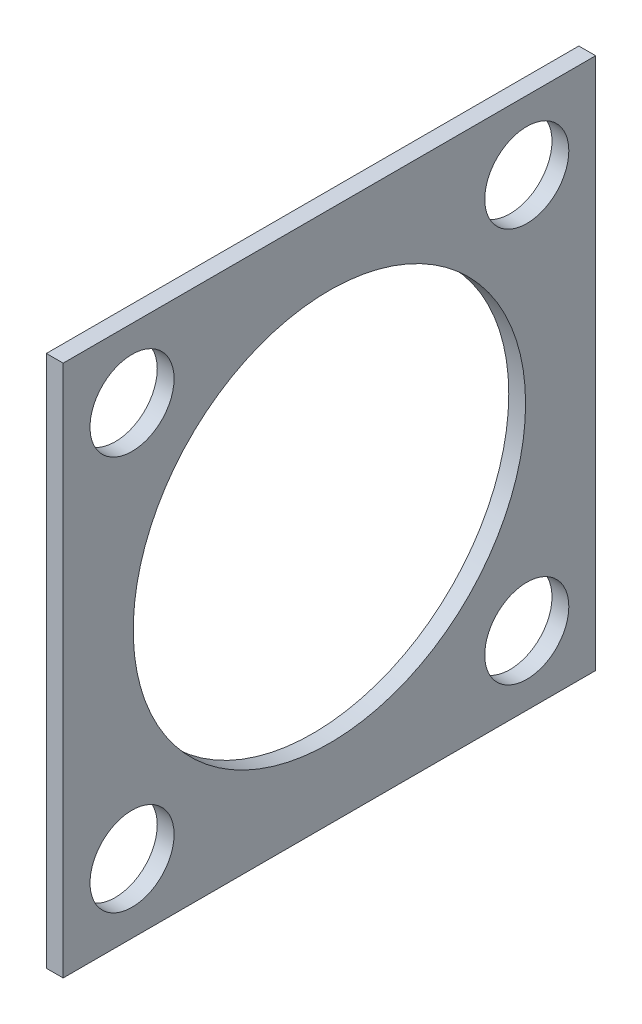
ISO-10303-21;
HEADER;
FILE_DESCRIPTION(('STEP AP214'),'2;1');
FILE_NAME('part.step','',(''),(''),'','','');
FILE_SCHEMA(('AUTOMOTIVE_DESIGN { 1 0 10303 214 1 1 1 1 }'));
ENDSEC;
DATA;
#1=APPLICATION_CONTEXT('core data for automotive mechanical design processes');
#2=APPLICATION_PROTOCOL_DEFINITION('international standard','automotive_design',2000,#1);
#3=PRODUCT_CONTEXT('',#1,'mechanical');
#4=PRODUCT('Part','Part','',(#3));
#5=PRODUCT_RELATED_PRODUCT_CATEGORY('part','',(#4));
#6=PRODUCT_DEFINITION_FORMATION('','',#4);
#7=PRODUCT_DEFINITION_CONTEXT('part definition',#1,'design');
#8=PRODUCT_DEFINITION('design','',#6,#7);
#9=PRODUCT_DEFINITION_SHAPE('','',#8);
#10=(LENGTH_UNIT() NAMED_UNIT(*) SI_UNIT(.MILLI.,.METRE.));
#11=(NAMED_UNIT(*) PLANE_ANGLE_UNIT() SI_UNIT($,.RADIAN.));
#12=(NAMED_UNIT(*) SI_UNIT($,.STERADIAN.) SOLID_ANGLE_UNIT());
#13=UNCERTAINTY_MEASURE_WITH_UNIT(LENGTH_MEASURE(1.E-05),#10,'distance_accuracy_value','');
#14=(GEOMETRIC_REPRESENTATION_CONTEXT(3) GLOBAL_UNCERTAINTY_ASSIGNED_CONTEXT((#13)) GLOBAL_UNIT_ASSIGNED_CONTEXT((#10,
#11,#12)) REPRESENTATION_CONTEXT('',''));
#15=CARTESIAN_POINT('',(0.,0.,0.));
#16=DIRECTION('',(0.,0.,1.));
#17=DIRECTION('',(1.,0.,0.));
#18=AXIS2_PLACEMENT_3D('',#15,#16,#17);
#19=CARTESIAN_POINT('',(-1.2,-19.,-19.));
#20=DIRECTION('',(0.,0.,-1.));
#21=DIRECTION('',(-1.,0.,0.));
#22=AXIS2_PLACEMENT_3D('',#19,#20,#21);
#23=PLANE('',#22);
#24=DIRECTION('',(0.,1.,0.));
#25=VECTOR('',#24,1.);
#26=CARTESIAN_POINT('',(0.,-19.,-19.));
#27=LINE('',#26,#25);
#28=CARTESIAN_POINT('',(0.,-19.,-19.));
#29=VERTEX_POINT('',#28);
#30=CARTESIAN_POINT('',(0.,19.,-19.));
#31=VERTEX_POINT('',#30);
#32=EDGE_CURVE('E113',#29,#31,#27,.T.);
#33=ORIENTED_EDGE('',*,*,#32,.F.);
#34=DIRECTION('',(1.,0.,0.));
#35=VECTOR('',#34,1.);
#36=CARTESIAN_POINT('',(-1.2,-19.,-19.));
#37=LINE('',#36,#35);
#38=CARTESIAN_POINT('',(-1.2,-19.,-19.));
#39=VERTEX_POINT('',#38);
#40=EDGE_CURVE('E13',#39,#29,#37,.T.);
#41=ORIENTED_EDGE('',*,*,#40,.F.);
#42=DIRECTION('',(0.,1.,0.));
#43=VECTOR('',#42,1.);
#44=CARTESIAN_POINT('',(-1.2,-19.,-19.));
#45=LINE('',#44,#43);
#46=CARTESIAN_POINT('',(-1.2,19.,-19.));
#47=VERTEX_POINT('',#46);
#48=EDGE_CURVE('E106',#39,#47,#45,.T.);
#49=ORIENTED_EDGE('',*,*,#48,.T.);
#50=DIRECTION('',(1.,0.,0.));
#51=VECTOR('',#50,1.);
#52=CARTESIAN_POINT('',(-1.2,19.,-19.));
#53=LINE('',#52,#51);
#54=EDGE_CURVE('E51',#47,#31,#53,.T.);
#55=ORIENTED_EDGE('',*,*,#54,.T.);
#56=EDGE_LOOP('',(#33,#41,#49,#55));
#57=FACE_BOUND('',#56,.T.);
#58=ADVANCED_FACE('F48',(#57),#23,.T.);
#59=CARTESIAN_POINT('',(-1.2,-19.,19.));
#60=DIRECTION('',(0.,-1.,0.));
#61=DIRECTION('',(0.,0.,-1.));
#62=AXIS2_PLACEMENT_3D('',#59,#60,#61);
#63=PLANE('',#62);
#64=DIRECTION('',(0.,0.,-1.));
#65=VECTOR('',#64,1.);
#66=CARTESIAN_POINT('',(0.,-19.,19.));
#67=LINE('',#66,#65);
#68=CARTESIAN_POINT('',(0.,-19.,19.));
#69=VERTEX_POINT('',#68);
#70=EDGE_CURVE('E108',#69,#29,#67,.T.);
#71=ORIENTED_EDGE('',*,*,#70,.F.);
#72=DIRECTION('',(1.,0.,0.));
#73=VECTOR('',#72,1.);
#74=CARTESIAN_POINT('',(-1.2,-19.,19.));
#75=LINE('',#74,#73);
#76=CARTESIAN_POINT('',(-1.2,-19.,19.));
#77=VERTEX_POINT('',#76);
#78=EDGE_CURVE('E57',#77,#69,#75,.T.);
#79=ORIENTED_EDGE('',*,*,#78,.F.);
#80=DIRECTION('',(0.,0.,-1.));
#81=VECTOR('',#80,1.);
#82=CARTESIAN_POINT('',(-1.2,-19.,19.));
#83=LINE('',#82,#81);
#84=EDGE_CURVE('E103',#77,#39,#83,.T.);
#85=ORIENTED_EDGE('',*,*,#84,.T.);
#86=ORIENTED_EDGE('',*,*,#40,.T.);
#87=EDGE_LOOP('',(#71,#79,#85,#86));
#88=FACE_BOUND('',#87,.T.);
#89=ADVANCED_FACE('F124',(#88),#63,.T.);
#90=CARTESIAN_POINT('',(-1.2,-19.,19.));
#91=DIRECTION('',(0.,0.,1.));
#92=DIRECTION('',(1.,0.,0.));
#93=AXIS2_PLACEMENT_3D('',#90,#91,#92);
#94=PLANE('',#93);
#95=DIRECTION('',(0.,-1.,0.));
#96=VECTOR('',#95,1.);
#97=CARTESIAN_POINT('',(0.,-19.,19.));
#98=LINE('',#97,#96);
#99=CARTESIAN_POINT('',(0.,19.,19.));
#100=VERTEX_POINT('',#99);
#101=EDGE_CURVE('E98',#100,#69,#98,.T.);
#102=ORIENTED_EDGE('',*,*,#101,.F.);
#103=DIRECTION('',(1.,0.,0.));
#104=VECTOR('',#103,1.);
#105=CARTESIAN_POINT('',(-1.2,19.,19.));
#106=LINE('',#105,#104);
#107=CARTESIAN_POINT('',(-1.2,19.,19.));
#108=VERTEX_POINT('',#107);
#109=EDGE_CURVE('E93',#108,#100,#106,.T.);
#110=ORIENTED_EDGE('',*,*,#109,.F.);
#111=DIRECTION('',(0.,-1.,0.));
#112=VECTOR('',#111,1.);
#113=CARTESIAN_POINT('',(-1.2,-19.,19.));
#114=LINE('',#113,#112);
#115=EDGE_CURVE('E96',#108,#77,#114,.T.);
#116=ORIENTED_EDGE('',*,*,#115,.T.);
#117=ORIENTED_EDGE('',*,*,#78,.T.);
#118=EDGE_LOOP('',(#102,#110,#116,#117));
#119=FACE_BOUND('',#118,.T.);
#120=ADVANCED_FACE('F95',(#119),#94,.T.);
#121=CARTESIAN_POINT('',(-1.2,19.,19.));
#122=DIRECTION('',(0.,1.,0.));
#123=DIRECTION('',(0.,0.,1.));
#124=AXIS2_PLACEMENT_3D('',#121,#122,#123);
#125=PLANE('',#124);
#126=DIRECTION('',(0.,0.,1.));
#127=VECTOR('',#126,1.);
#128=CARTESIAN_POINT('',(0.,19.,19.));
#129=LINE('',#128,#127);
#130=EDGE_CURVE('E116',#31,#100,#129,.T.);
#131=ORIENTED_EDGE('',*,*,#130,.F.);
#132=ORIENTED_EDGE('',*,*,#54,.F.);
#133=DIRECTION('',(0.,0.,1.));
#134=VECTOR('',#133,1.);
#135=CARTESIAN_POINT('',(-1.2,19.,19.));
#136=LINE('',#135,#134);
#137=EDGE_CURVE('E102',#47,#108,#136,.T.);
#138=ORIENTED_EDGE('',*,*,#137,.T.);
#139=ORIENTED_EDGE('',*,*,#109,.T.);
#140=EDGE_LOOP('',(#131,#132,#138,#139));
#141=FACE_BOUND('',#140,.T.);
#142=ADVANCED_FACE('F105',(#141),#125,.T.);
#143=CARTESIAN_POINT('',(-1.2,0.,0.));
#144=DIRECTION('',(-1.,0.,0.));
#145=DIRECTION('',(0.,0.,1.));
#146=AXIS2_PLACEMENT_3D('',#143,#144,#145);
#147=PLANE('',#146);
#148=CARTESIAN_POINT('',(-1.2,-14.085,-14.085));
#149=DIRECTION('',(1.,0.,0.));
#150=DIRECTION('',(0.,0.,-1.));
#151=AXIS2_PLACEMENT_3D('',#148,#149,#150);
#152=CIRCLE('',#151,3.);
#153=CARTESIAN_POINT('',(-1.2,-14.085,-17.085));
#154=VERTEX_POINT('',#153);
#155=EDGE_CURVE('E169',#154,#154,#152,.T.);
#156=ORIENTED_EDGE('',*,*,#155,.T.);
#157=EDGE_LOOP('',(#156));
#158=FACE_BOUND('',#157,.T.);
#159=CARTESIAN_POINT('',(-1.2,14.085,-14.085));
#160=DIRECTION('',(1.,0.,0.));
#161=DIRECTION('',(0.,0.,-1.));
#162=AXIS2_PLACEMENT_3D('',#159,#160,#161);
#163=CIRCLE('',#162,3.);
#164=CARTESIAN_POINT('',(-1.2,14.085,-17.085));
#165=VERTEX_POINT('',#164);
#166=EDGE_CURVE('E177',#165,#165,#163,.T.);
#167=ORIENTED_EDGE('',*,*,#166,.T.);
#168=EDGE_LOOP('',(#167));
#169=FACE_BOUND('',#168,.T.);
#170=CARTESIAN_POINT('',(-1.2,14.085,14.085));
#171=DIRECTION('',(1.,0.,0.));
#172=DIRECTION('',(0.,0.,-1.));
#173=AXIS2_PLACEMENT_3D('',#170,#171,#172);
#174=CIRCLE('',#173,3.);
#175=CARTESIAN_POINT('',(-1.2,14.085,11.085));
#176=VERTEX_POINT('',#175);
#177=EDGE_CURVE('E183',#176,#176,#174,.T.);
#178=ORIENTED_EDGE('',*,*,#177,.T.);
#179=EDGE_LOOP('',(#178));
#180=FACE_BOUND('',#179,.T.);
#181=CARTESIAN_POINT('',(-1.2,-14.085,14.085));
#182=DIRECTION('',(1.,0.,0.));
#183=DIRECTION('',(0.,0.,-1.));
#184=AXIS2_PLACEMENT_3D('',#181,#182,#183);
#185=CIRCLE('',#184,3.);
#186=CARTESIAN_POINT('',(-1.2,-14.085,11.085));
#187=VERTEX_POINT('',#186);
#188=EDGE_CURVE('E189',#187,#187,#185,.T.);
#189=ORIENTED_EDGE('',*,*,#188,.T.);
#190=EDGE_LOOP('',(#189));
#191=FACE_BOUND('',#190,.T.);
#192=CARTESIAN_POINT('',(-1.2,0.,0.));
#193=DIRECTION('',(1.,0.,0.));
#194=DIRECTION('',(0.,0.,-1.));
#195=AXIS2_PLACEMENT_3D('',#192,#193,#194);
#196=CIRCLE('',#195,14.);
#197=CARTESIAN_POINT('',(-1.2,0.,-14.));
#198=VERTEX_POINT('',#197);
#199=EDGE_CURVE('E117',#198,#198,#196,.T.);
#200=ORIENTED_EDGE('',*,*,#199,.T.);
#201=EDGE_LOOP('',(#200));
#202=FACE_BOUND('',#201,.T.);
#203=ORIENTED_EDGE('',*,*,#48,.F.);
#204=ORIENTED_EDGE('',*,*,#84,.F.);
#205=ORIENTED_EDGE('',*,*,#115,.F.);
#206=ORIENTED_EDGE('',*,*,#137,.F.);
#207=EDGE_LOOP('',(#203,#204,#205,#206));
#208=FACE_BOUND('',#207,.T.);
#209=ADVANCED_FACE('F101',(#158,#169,#180,#191,#202,#208),#147,.T.);
#210=CARTESIAN_POINT('',(0.,0.,0.));
#211=DIRECTION('',(-1.,0.,0.));
#212=DIRECTION('',(0.,0.,1.));
#213=AXIS2_PLACEMENT_3D('',#210,#211,#212);
#214=PLANE('',#213);
#215=CARTESIAN_POINT('',(0.,-14.085,-14.085));
#216=DIRECTION('',(1.,0.,0.));
#217=DIRECTION('',(0.,0.,-1.));
#218=AXIS2_PLACEMENT_3D('',#215,#216,#217);
#219=CIRCLE('',#218,3.);
#220=CARTESIAN_POINT('',(0.,-14.085,-17.085));
#221=VERTEX_POINT('',#220);
#222=EDGE_CURVE('E172',#221,#221,#219,.T.);
#223=ORIENTED_EDGE('',*,*,#222,.F.);
#224=EDGE_LOOP('',(#223));
#225=FACE_BOUND('',#224,.T.);
#226=CARTESIAN_POINT('',(0.,14.085,-14.085));
#227=DIRECTION('',(1.,0.,0.));
#228=DIRECTION('',(0.,0.,-1.));
#229=AXIS2_PLACEMENT_3D('',#226,#227,#228);
#230=CIRCLE('',#229,3.);
#231=CARTESIAN_POINT('',(0.,14.085,-17.085));
#232=VERTEX_POINT('',#231);
#233=EDGE_CURVE('E174',#232,#232,#230,.T.);
#234=ORIENTED_EDGE('',*,*,#233,.F.);
#235=EDGE_LOOP('',(#234));
#236=FACE_BOUND('',#235,.T.);
#237=CARTESIAN_POINT('',(0.,14.085,14.085));
#238=DIRECTION('',(1.,0.,0.));
#239=DIRECTION('',(0.,0.,-1.));
#240=AXIS2_PLACEMENT_3D('',#237,#238,#239);
#241=CIRCLE('',#240,3.);
#242=CARTESIAN_POINT('',(0.,14.085,11.085));
#243=VERTEX_POINT('',#242);
#244=EDGE_CURVE('E180',#243,#243,#241,.T.);
#245=ORIENTED_EDGE('',*,*,#244,.F.);
#246=EDGE_LOOP('',(#245));
#247=FACE_BOUND('',#246,.T.);
#248=CARTESIAN_POINT('',(0.,-14.085,14.085));
#249=DIRECTION('',(1.,0.,0.));
#250=DIRECTION('',(0.,0.,-1.));
#251=AXIS2_PLACEMENT_3D('',#248,#249,#250);
#252=CIRCLE('',#251,3.);
#253=CARTESIAN_POINT('',(0.,-14.085,11.085));
#254=VERTEX_POINT('',#253);
#255=EDGE_CURVE('E186',#254,#254,#252,.T.);
#256=ORIENTED_EDGE('',*,*,#255,.F.);
#257=EDGE_LOOP('',(#256));
#258=FACE_BOUND('',#257,.T.);
#259=CARTESIAN_POINT('',(0.,0.,0.));
#260=DIRECTION('',(1.,0.,0.));
#261=DIRECTION('',(0.,0.,-1.));
#262=AXIS2_PLACEMENT_3D('',#259,#260,#261);
#263=CIRCLE('',#262,14.);
#264=CARTESIAN_POINT('',(0.,0.,-14.));
#265=VERTEX_POINT('',#264);
#266=EDGE_CURVE('E192',#265,#265,#263,.T.);
#267=ORIENTED_EDGE('',*,*,#266,.F.);
#268=EDGE_LOOP('',(#267));
#269=FACE_BOUND('',#268,.T.);
#270=ORIENTED_EDGE('',*,*,#32,.T.);
#271=ORIENTED_EDGE('',*,*,#130,.T.);
#272=ORIENTED_EDGE('',*,*,#101,.T.);
#273=ORIENTED_EDGE('',*,*,#70,.T.);
#274=EDGE_LOOP('',(#270,#271,#272,#273));
#275=FACE_BOUND('',#274,.T.);
#276=ADVANCED_FACE('F123',(#225,#236,#247,#258,#269,#275),#214,.F.);
#277=CARTESIAN_POINT('',(-1.2,0.,0.));
#278=DIRECTION('',(1.,0.,0.));
#279=DIRECTION('',(0.,0.,-1.));
#280=AXIS2_PLACEMENT_3D('',#277,#278,#279);
#281=CYLINDRICAL_SURFACE('',#280,14.);
#282=ORIENTED_EDGE('',*,*,#199,.F.);
#283=EDGE_LOOP('',(#282));
#284=FACE_BOUND('',#283,.T.);
#285=ORIENTED_EDGE('',*,*,#266,.T.);
#286=EDGE_LOOP('',(#285));
#287=FACE_BOUND('',#286,.T.);
#288=ADVANCED_FACE('F142',(#284,#287),#281,.F.);
#289=CARTESIAN_POINT('',(-1.2,-14.085,14.085));
#290=DIRECTION('',(1.,0.,0.));
#291=DIRECTION('',(0.,0.,-1.));
#292=AXIS2_PLACEMENT_3D('',#289,#290,#291);
#293=CYLINDRICAL_SURFACE('',#292,3.);
#294=ORIENTED_EDGE('',*,*,#188,.F.);
#295=EDGE_LOOP('',(#294));
#296=FACE_BOUND('',#295,.T.);
#297=ORIENTED_EDGE('',*,*,#255,.T.);
#298=EDGE_LOOP('',(#297));
#299=FACE_BOUND('',#298,.T.);
#300=ADVANCED_FACE('F149',(#296,#299),#293,.F.);
#301=CARTESIAN_POINT('',(-1.2,14.085,14.085));
#302=DIRECTION('',(1.,0.,0.));
#303=DIRECTION('',(0.,0.,-1.));
#304=AXIS2_PLACEMENT_3D('',#301,#302,#303);
#305=CYLINDRICAL_SURFACE('',#304,3.);
#306=ORIENTED_EDGE('',*,*,#177,.F.);
#307=EDGE_LOOP('',(#306));
#308=FACE_BOUND('',#307,.T.);
#309=ORIENTED_EDGE('',*,*,#244,.T.);
#310=EDGE_LOOP('',(#309));
#311=FACE_BOUND('',#310,.T.);
#312=ADVANCED_FACE('F153',(#308,#311),#305,.F.);
#313=CARTESIAN_POINT('',(-1.2,14.085,-14.085));
#314=DIRECTION('',(1.,0.,0.));
#315=DIRECTION('',(0.,0.,-1.));
#316=AXIS2_PLACEMENT_3D('',#313,#314,#315);
#317=CYLINDRICAL_SURFACE('',#316,3.);
#318=ORIENTED_EDGE('',*,*,#166,.F.);
#319=EDGE_LOOP('',(#318));
#320=FACE_BOUND('',#319,.T.);
#321=ORIENTED_EDGE('',*,*,#233,.T.);
#322=EDGE_LOOP('',(#321));
#323=FACE_BOUND('',#322,.T.);
#324=ADVANCED_FACE('F157',(#320,#323),#317,.F.);
#325=CARTESIAN_POINT('',(-1.2,-14.085,-14.085));
#326=DIRECTION('',(1.,0.,0.));
#327=DIRECTION('',(0.,0.,-1.));
#328=AXIS2_PLACEMENT_3D('',#325,#326,#327);
#329=CYLINDRICAL_SURFACE('',#328,3.);
#330=ORIENTED_EDGE('',*,*,#155,.F.);
#331=EDGE_LOOP('',(#330));
#332=FACE_BOUND('',#331,.T.);
#333=ORIENTED_EDGE('',*,*,#222,.T.);
#334=EDGE_LOOP('',(#333));
#335=FACE_BOUND('',#334,.T.);
#336=ADVANCED_FACE('F161',(#332,#335),#329,.F.);
#337=CLOSED_SHELL('',(#58,#89,#120,#142,#209,#276,#288,#300,#312,#324,#336));
#338=MANIFOLD_SOLID_BREP('B2',#337);
#339=ADVANCED_BREP_SHAPE_REPRESENTATION('',(#18,#338),#14);
#340=SHAPE_DEFINITION_REPRESENTATION(#9,#339);
ENDSEC;
END-ISO-10303-21;
